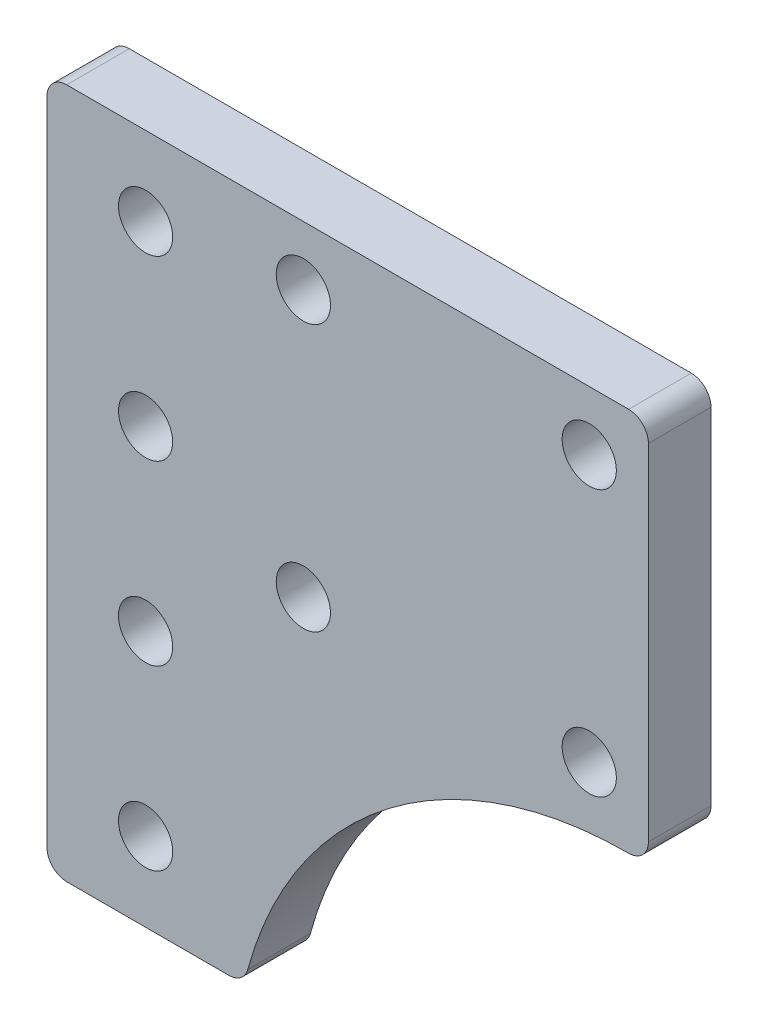
ISO-10303-21;
HEADER;
FILE_DESCRIPTION(('STEP AP214'),'2;1');
FILE_NAME('part.step','',(''),(''),'','','');
FILE_SCHEMA(('AUTOMOTIVE_DESIGN { 1 0 10303 214 1 1 1 1 }'));
ENDSEC;
DATA;
#1=APPLICATION_CONTEXT('core data for automotive mechanical design processes');
#2=APPLICATION_PROTOCOL_DEFINITION('international standard','automotive_design',2000,#1);
#3=PRODUCT_CONTEXT('',#1,'mechanical');
#4=PRODUCT('Part','Part','',(#3));
#5=PRODUCT_RELATED_PRODUCT_CATEGORY('part','',(#4));
#6=PRODUCT_DEFINITION_FORMATION('','',#4);
#7=PRODUCT_DEFINITION_CONTEXT('part definition',#1,'design');
#8=PRODUCT_DEFINITION('design','',#6,#7);
#9=PRODUCT_DEFINITION_SHAPE('','',#8);
#10=(LENGTH_UNIT() NAMED_UNIT(*) SI_UNIT(.MILLI.,.METRE.));
#11=(NAMED_UNIT(*) PLANE_ANGLE_UNIT() SI_UNIT($,.RADIAN.));
#12=(NAMED_UNIT(*) SI_UNIT($,.STERADIAN.) SOLID_ANGLE_UNIT());
#13=UNCERTAINTY_MEASURE_WITH_UNIT(LENGTH_MEASURE(1.E-05),#10,'distance_accuracy_value','');
#14=(GEOMETRIC_REPRESENTATION_CONTEXT(3) GLOBAL_UNCERTAINTY_ASSIGNED_CONTEXT((#13)) GLOBAL_UNIT_ASSIGNED_CONTEXT((#10,
#11,#12)) REPRESENTATION_CONTEXT('',''));
#15=CARTESIAN_POINT('',(0.,0.,0.));
#16=DIRECTION('',(0.,0.,1.));
#17=DIRECTION('',(1.,0.,0.));
#18=AXIS2_PLACEMENT_3D('',#15,#16,#17);
#19=CARTESIAN_POINT('',(0.,70.,6.35));
#20=DIRECTION('',(1.,0.,0.));
#21=DIRECTION('',(0.,0.,-1.));
#22=AXIS2_PLACEMENT_3D('',#19,#20,#21);
#23=PLANE('',#22);
#24=DIRECTION('',(0.,-1.,0.));
#25=VECTOR('',#24,1.);
#26=CARTESIAN_POINT('',(0.,70.,6.35));
#27=LINE('',#26,#25);
#28=CARTESIAN_POINT('',(0.,68.,6.35));
#29=VERTEX_POINT('',#28);
#30=CARTESIAN_POINT('',(0.,2.,6.35));
#31=VERTEX_POINT('',#30);
#32=EDGE_CURVE('E160',#29,#31,#27,.T.);
#33=ORIENTED_EDGE('',*,*,#32,.F.);
#34=DIRECTION('',(0.,0.,-1.));
#35=VECTOR('',#34,1.);
#36=CARTESIAN_POINT('',(0.,68.,6.35));
#37=LINE('',#36,#35);
#38=CARTESIAN_POINT('',(0.,68.,0.));
#39=VERTEX_POINT('',#38);
#40=EDGE_CURVE('E165',#29,#39,#37,.T.);
#41=ORIENTED_EDGE('',*,*,#40,.T.);
#42=DIRECTION('',(0.,-1.,0.));
#43=VECTOR('',#42,1.);
#44=CARTESIAN_POINT('',(0.,70.,0.));
#45=LINE('',#44,#43);
#46=CARTESIAN_POINT('',(0.,2.,0.));
#47=VERTEX_POINT('',#46);
#48=EDGE_CURVE('E155',#39,#47,#45,.T.);
#49=ORIENTED_EDGE('',*,*,#48,.T.);
#50=DIRECTION('',(0.,0.,-1.));
#51=VECTOR('',#50,1.);
#52=CARTESIAN_POINT('',(0.,2.,6.35));
#53=LINE('',#52,#51);
#54=EDGE_CURVE('E163',#47,#31,#53,.F.);
#55=ORIENTED_EDGE('',*,*,#54,.T.);
#56=EDGE_LOOP('',(#33,#41,#49,#55));
#57=FACE_BOUND('',#56,.T.);
#58=ADVANCED_FACE('F41',(#57),#23,.F.);
#59=CARTESIAN_POINT('',(0.,0.,6.35));
#60=DIRECTION('',(0.,1.,0.));
#61=DIRECTION('',(0.,0.,1.));
#62=AXIS2_PLACEMENT_3D('',#59,#60,#61);
#63=PLANE('',#62);
#64=DIRECTION('',(1.,0.,0.));
#65=VECTOR('',#64,1.);
#66=CARTESIAN_POINT('',(0.,0.,6.35));
#67=LINE('',#66,#65);
#68=CARTESIAN_POINT('',(2.,0.,6.35));
#69=VERTEX_POINT('',#68);
#70=CARTESIAN_POINT('',(18.4404141407877,0.,6.35));
#71=VERTEX_POINT('',#70);
#72=EDGE_CURVE('E206',#69,#71,#67,.T.);
#73=ORIENTED_EDGE('',*,*,#72,.F.);
#74=DIRECTION('',(0.,0.,-1.));
#75=VECTOR('',#74,1.);
#76=CARTESIAN_POINT('',(2.,0.,6.35));
#77=LINE('',#76,#75);
#78=CARTESIAN_POINT('',(2.,0.,0.));
#79=VERTEX_POINT('',#78);
#80=EDGE_CURVE('E49',#69,#79,#77,.T.);
#81=ORIENTED_EDGE('',*,*,#80,.T.);
#82=DIRECTION('',(1.,0.,0.));
#83=VECTOR('',#82,1.);
#84=CARTESIAN_POINT('',(0.,0.,0.));
#85=LINE('',#84,#83);
#86=CARTESIAN_POINT('',(18.4404141407877,0.,0.));
#87=VERTEX_POINT('',#86);
#88=EDGE_CURVE('E150',#79,#87,#85,.T.);
#89=ORIENTED_EDGE('',*,*,#88,.T.);
#90=DIRECTION('',(0.,0.,-1.));
#91=VECTOR('',#90,1.);
#92=CARTESIAN_POINT('',(18.4404141407877,0.,6.35));
#93=LINE('',#92,#91);
#94=EDGE_CURVE('E197',#87,#71,#93,.F.);
#95=ORIENTED_EDGE('',*,*,#94,.T.);
#96=EDGE_LOOP('',(#73,#81,#89,#95));
#97=FACE_BOUND('',#96,.T.);
#98=ADVANCED_FACE('F203',(#97),#63,.F.);
#99=CARTESIAN_POINT('',(20.,31.,6.35));
#100=DIRECTION('',(0.,1.,0.));
#101=DIRECTION('',(0.,0.,1.));
#102=AXIS2_PLACEMENT_3D('',#99,#100,#101);
#103=PLANE('',#102);
#104=DIRECTION('',(1.,0.,0.));
#105=VECTOR('',#104,1.);
#106=CARTESIAN_POINT('',(20.,31.,0.));
#107=LINE('',#106,#105);
#108=CARTESIAN_POINT('',(58.9743505398101,31.,0.));
#109=VERTEX_POINT('',#108);
#110=CARTESIAN_POINT('',(59.,31.,0.));
#111=VERTEX_POINT('',#110);
#112=EDGE_CURVE('E140',#109,#111,#107,.T.);
#113=ORIENTED_EDGE('',*,*,#112,.T.);
#114=DIRECTION('',(0.,0.,-1.));
#115=VECTOR('',#114,1.);
#116=CARTESIAN_POINT('',(59.,31.,6.35));
#117=LINE('',#116,#115);
#118=CARTESIAN_POINT('',(59.,31.,6.35));
#119=VERTEX_POINT('',#118);
#120=EDGE_CURVE('E195',#111,#119,#117,.F.);
#121=ORIENTED_EDGE('',*,*,#120,.T.);
#122=DIRECTION('',(1.,0.,0.));
#123=VECTOR('',#122,1.);
#124=CARTESIAN_POINT('',(20.,31.,6.35));
#125=LINE('',#124,#123);
#126=CARTESIAN_POINT('',(58.9743505398101,31.,6.35));
#127=VERTEX_POINT('',#126);
#128=EDGE_CURVE('E142',#127,#119,#125,.T.);
#129=ORIENTED_EDGE('',*,*,#128,.F.);
#130=DIRECTION('',(0.,0.,-1.));
#131=VECTOR('',#130,1.);
#132=CARTESIAN_POINT('',(58.9743505398101,31.,6.35));
#133=LINE('',#132,#131);
#134=EDGE_CURVE('E130',#127,#109,#133,.T.);
#135=ORIENTED_EDGE('',*,*,#134,.T.);
#136=EDGE_LOOP('',(#113,#121,#129,#135));
#137=FACE_BOUND('',#136,.T.);
#138=ADVANCED_FACE('F139',(#137),#103,.F.);
#139=CARTESIAN_POINT('',(61.,31.,6.35));
#140=DIRECTION('',(-1.,0.,0.));
#141=DIRECTION('',(0.,-1.,0.));
#142=AXIS2_PLACEMENT_3D('',#139,#140,#141);
#143=PLANE('',#142);
#144=DIRECTION('',(0.,1.,0.));
#145=VECTOR('',#144,1.);
#146=CARTESIAN_POINT('',(61.,31.,0.));
#147=LINE('',#146,#145);
#148=CARTESIAN_POINT('',(61.,33.,0.));
#149=VERTEX_POINT('',#148);
#150=CARTESIAN_POINT('',(61.,68.,0.));
#151=VERTEX_POINT('',#150);
#152=EDGE_CURVE('E149',#149,#151,#147,.T.);
#153=ORIENTED_EDGE('',*,*,#152,.T.);
#154=DIRECTION('',(0.,0.,-1.));
#155=VECTOR('',#154,1.);
#156=CARTESIAN_POINT('',(61.,68.,6.35));
#157=LINE('',#156,#155);
#158=CARTESIAN_POINT('',(61.,68.,6.35));
#159=VERTEX_POINT('',#158);
#160=EDGE_CURVE('E56',#151,#159,#157,.F.);
#161=ORIENTED_EDGE('',*,*,#160,.T.);
#162=DIRECTION('',(0.,1.,0.));
#163=VECTOR('',#162,1.);
#164=CARTESIAN_POINT('',(61.,31.,6.35));
#165=LINE('',#164,#163);
#166=CARTESIAN_POINT('',(61.,33.,6.35));
#167=VERTEX_POINT('',#166);
#168=EDGE_CURVE('E216',#167,#159,#165,.T.);
#169=ORIENTED_EDGE('',*,*,#168,.F.);
#170=DIRECTION('',(0.,0.,-1.));
#171=VECTOR('',#170,1.);
#172=CARTESIAN_POINT('',(61.,33.,6.35));
#173=LINE('',#172,#171);
#174=EDGE_CURVE('E191',#167,#149,#173,.T.);
#175=ORIENTED_EDGE('',*,*,#174,.T.);
#176=EDGE_LOOP('',(#153,#161,#169,#175));
#177=FACE_BOUND('',#176,.T.);
#178=ADVANCED_FACE('F348',(#177),#143,.F.);
#179=CARTESIAN_POINT('',(61.,70.,6.35));
#180=DIRECTION('',(0.,-1.,0.));
#181=DIRECTION('',(1.,0.,0.));
#182=AXIS2_PLACEMENT_3D('',#179,#180,#181);
#183=PLANE('',#182);
#184=DIRECTION('',(-1.,0.,0.));
#185=VECTOR('',#184,1.);
#186=CARTESIAN_POINT('',(61.,70.,0.));
#187=LINE('',#186,#185);
#188=CARTESIAN_POINT('',(59.,70.,0.));
#189=VERTEX_POINT('',#188);
#190=CARTESIAN_POINT('',(2.00000000000002,70.,0.));
#191=VERTEX_POINT('',#190);
#192=EDGE_CURVE('E152',#189,#191,#187,.T.);
#193=ORIENTED_EDGE('',*,*,#192,.T.);
#194=DIRECTION('',(0.,0.,-1.));
#195=VECTOR('',#194,1.);
#196=CARTESIAN_POINT('',(2.,70.,6.35));
#197=LINE('',#196,#195);
#198=CARTESIAN_POINT('',(2.00000000000002,70.,6.35));
#199=VERTEX_POINT('',#198);
#200=EDGE_CURVE('E180',#191,#199,#197,.F.);
#201=ORIENTED_EDGE('',*,*,#200,.T.);
#202=DIRECTION('',(-1.,0.,0.));
#203=VECTOR('',#202,1.);
#204=CARTESIAN_POINT('',(61.,70.,6.35));
#205=LINE('',#204,#203);
#206=CARTESIAN_POINT('',(59.,70.,6.35));
#207=VERTEX_POINT('',#206);
#208=EDGE_CURVE('E143',#207,#199,#205,.T.);
#209=ORIENTED_EDGE('',*,*,#208,.F.);
#210=DIRECTION('',(0.,0.,-1.));
#211=VECTOR('',#210,1.);
#212=CARTESIAN_POINT('',(59.,70.,6.35));
#213=LINE('',#212,#211);
#214=EDGE_CURVE('E177',#207,#189,#213,.T.);
#215=ORIENTED_EDGE('',*,*,#214,.T.);
#216=EDGE_LOOP('',(#193,#201,#209,#215));
#217=FACE_BOUND('',#216,.T.);
#218=ADVANCED_FACE('F286',(#217),#183,.F.);
#219=CARTESIAN_POINT('',(0.,0.,6.35));
#220=DIRECTION('',(0.,0.,1.));
#221=DIRECTION('',(1.,0.,0.));
#222=AXIS2_PLACEMENT_3D('',#219,#220,#221);
#223=PLANE('',#222);
#224=CARTESIAN_POINT('',(10.,8.00000000000001,6.35));
#225=DIRECTION('',(0.,0.,1.));
#226=DIRECTION('',(1.,0.,0.));
#227=AXIS2_PLACEMENT_3D('',#224,#225,#226);
#228=CIRCLE('',#227,2.75);
#229=CARTESIAN_POINT('',(12.75,8.00000000000001,6.35));
#230=VERTEX_POINT('',#229);
#231=EDGE_CURVE('E269',#230,#230,#228,.T.);
#232=ORIENTED_EDGE('',*,*,#231,.F.);
#233=EDGE_LOOP('',(#232));
#234=FACE_BOUND('',#233,.T.);
#235=CARTESIAN_POINT('',(10.,26.,6.35));
#236=DIRECTION('',(0.,0.,1.));
#237=DIRECTION('',(1.,0.,0.));
#238=AXIS2_PLACEMENT_3D('',#235,#236,#237);
#239=CIRCLE('',#238,2.75);
#240=CARTESIAN_POINT('',(12.75,26.,6.35));
#241=VERTEX_POINT('',#240);
#242=EDGE_CURVE('E266',#241,#241,#239,.T.);
#243=ORIENTED_EDGE('',*,*,#242,.F.);
#244=EDGE_LOOP('',(#243));
#245=FACE_BOUND('',#244,.T.);
#246=CARTESIAN_POINT('',(10.,44.,6.35));
#247=DIRECTION('',(0.,0.,1.));
#248=DIRECTION('',(1.,0.,0.));
#249=AXIS2_PLACEMENT_3D('',#246,#247,#248);
#250=CIRCLE('',#249,2.75);
#251=CARTESIAN_POINT('',(12.75,44.,6.35));
#252=VERTEX_POINT('',#251);
#253=EDGE_CURVE('E260',#252,#252,#250,.T.);
#254=ORIENTED_EDGE('',*,*,#253,.F.);
#255=EDGE_LOOP('',(#254));
#256=FACE_BOUND('',#255,.T.);
#257=CARTESIAN_POINT('',(10.,62.,6.35));
#258=DIRECTION('',(0.,0.,1.));
#259=DIRECTION('',(1.,0.,0.));
#260=AXIS2_PLACEMENT_3D('',#257,#258,#259);
#261=CIRCLE('',#260,2.75);
#262=CARTESIAN_POINT('',(12.75,62.,6.35));
#263=VERTEX_POINT('',#262);
#264=EDGE_CURVE('E254',#263,#263,#261,.T.);
#265=ORIENTED_EDGE('',*,*,#264,.F.);
#266=EDGE_LOOP('',(#265));
#267=FACE_BOUND('',#266,.T.);
#268=CARTESIAN_POINT('',(26.0000012986734,36.9999999999963,6.35));
#269=DIRECTION('',(0.,0.,1.));
#270=DIRECTION('',(1.,0.,0.));
#271=AXIS2_PLACEMENT_3D('',#268,#269,#270);
#272=CIRCLE('',#271,2.74999999999869);
#273=CARTESIAN_POINT('',(28.750001298672,36.9999999999963,6.35));
#274=VERTEX_POINT('',#273);
#275=EDGE_CURVE('E222',#274,#274,#272,.T.);
#276=ORIENTED_EDGE('',*,*,#275,.F.);
#277=EDGE_LOOP('',(#276));
#278=FACE_BOUND('',#277,.T.);
#279=CARTESIAN_POINT('',(54.9999999999982,36.9999999999964,6.35));
#280=DIRECTION('',(0.,0.,1.));
#281=DIRECTION('',(1.,0.,0.));
#282=AXIS2_PLACEMENT_3D('',#279,#280,#281);
#283=CIRCLE('',#282,2.7499999999987);
#284=CARTESIAN_POINT('',(57.7499999999969,36.9999999999964,6.35));
#285=VERTEX_POINT('',#284);
#286=EDGE_CURVE('E226',#285,#285,#283,.T.);
#287=ORIENTED_EDGE('',*,*,#286,.F.);
#288=EDGE_LOOP('',(#287));
#289=FACE_BOUND('',#288,.T.);
#290=CARTESIAN_POINT('',(54.999998701323,63.9999999999964,6.35));
#291=DIRECTION('',(0.,0.,1.));
#292=DIRECTION('',(1.,0.,0.));
#293=AXIS2_PLACEMENT_3D('',#290,#291,#292);
#294=CIRCLE('',#293,2.7499999999987);
#295=CARTESIAN_POINT('',(57.7499987013217,63.9999999999964,6.35));
#296=VERTEX_POINT('',#295);
#297=EDGE_CURVE('E230',#296,#296,#294,.T.);
#298=ORIENTED_EDGE('',*,*,#297,.F.);
#299=EDGE_LOOP('',(#298));
#300=FACE_BOUND('',#299,.T.);
#301=CARTESIAN_POINT('',(25.9999999999981,63.9999999999963,6.35));
#302=DIRECTION('',(0.,0.,1.));
#303=DIRECTION('',(1.,0.,0.));
#304=AXIS2_PLACEMENT_3D('',#301,#302,#303);
#305=CIRCLE('',#304,2.74999999999869);
#306=CARTESIAN_POINT('',(28.7499999999968,63.9999999999963,6.35));
#307=VERTEX_POINT('',#306);
#308=EDGE_CURVE('E235',#307,#307,#305,.T.);
#309=ORIENTED_EDGE('',*,*,#308,.F.);
#310=EDGE_LOOP('',(#309));
#311=FACE_BOUND('',#310,.T.);
#312=ORIENTED_EDGE('',*,*,#208,.T.);
#313=CARTESIAN_POINT('',(2.,68.,6.35));
#314=DIRECTION('',(0.,0.,1.));
#315=DIRECTION('',(1.,0.,0.));
#316=AXIS2_PLACEMENT_3D('',#313,#314,#315);
#317=CIRCLE('',#316,2.);
#318=EDGE_CURVE('E189',#199,#29,#317,.T.);
#319=ORIENTED_EDGE('',*,*,#318,.T.);
#320=ORIENTED_EDGE('',*,*,#32,.T.);
#321=CARTESIAN_POINT('',(2.,2.,6.35));
#322=DIRECTION('',(0.,0.,1.));
#323=DIRECTION('',(1.,0.,0.));
#324=AXIS2_PLACEMENT_3D('',#321,#322,#323);
#325=CIRCLE('',#324,2.);
#326=EDGE_CURVE('E184',#31,#69,#325,.T.);
#327=ORIENTED_EDGE('',*,*,#326,.T.);
#328=ORIENTED_EDGE('',*,*,#72,.T.);
#329=CARTESIAN_POINT('',(18.4404141407877,2.,6.35));
#330=DIRECTION('',(0.,0.,1.));
#331=DIRECTION('',(1.,0.,0.));
#332=AXIS2_PLACEMENT_3D('',#329,#330,#331);
#333=CIRCLE('',#332,2.);
#334=CARTESIAN_POINT('',(20.3706015883602,1.47619047619048,6.35));
#335=VERTEX_POINT('',#334);
#336=EDGE_CURVE('E182',#71,#335,#333,.T.);
#337=ORIENTED_EDGE('',*,*,#336,.T.);
#338=CARTESIAN_POINT('',(58.9743505398101,-9.,6.35));
#339=DIRECTION('',(0.,0.,1.));
#340=DIRECTION('',(1.,0.,0.));
#341=AXIS2_PLACEMENT_3D('',#338,#339,#340);
#342=CIRCLE('',#341,40.);
#343=EDGE_CURVE('E134',#335,#127,#342,.F.);
#344=ORIENTED_EDGE('',*,*,#343,.T.);
#345=ORIENTED_EDGE('',*,*,#128,.T.);
#346=CARTESIAN_POINT('',(59.,33.,6.35));
#347=DIRECTION('',(0.,0.,1.));
#348=DIRECTION('',(1.,0.,0.));
#349=AXIS2_PLACEMENT_3D('',#346,#347,#348);
#350=CIRCLE('',#349,2.);
#351=EDGE_CURVE('E63',#119,#167,#350,.T.);
#352=ORIENTED_EDGE('',*,*,#351,.T.);
#353=ORIENTED_EDGE('',*,*,#168,.T.);
#354=CARTESIAN_POINT('',(59.,68.,6.35));
#355=DIRECTION('',(0.,0.,1.));
#356=DIRECTION('',(1.,0.,0.));
#357=AXIS2_PLACEMENT_3D('',#354,#355,#356);
#358=CIRCLE('',#357,2.);
#359=EDGE_CURVE('E187',#159,#207,#358,.T.);
#360=ORIENTED_EDGE('',*,*,#359,.T.);
#361=EDGE_LOOP('',(#312,#319,#320,#327,#328,#337,#344,#345,#352,#353,#360));
#362=FACE_BOUND('',#361,.T.);
#363=ADVANCED_FACE('F213',(#234,#245,#256,#267,#278,#289,#300,#311,#362),#223,.T.);
#364=CARTESIAN_POINT('',(0.,0.,0.));
#365=DIRECTION('',(0.,0.,1.));
#366=DIRECTION('',(1.,0.,0.));
#367=AXIS2_PLACEMENT_3D('',#364,#365,#366);
#368=PLANE('',#367);
#369=CARTESIAN_POINT('',(10.,8.00000000000001,0.));
#370=DIRECTION('',(0.,0.,1.));
#371=DIRECTION('',(1.,0.,0.));
#372=AXIS2_PLACEMENT_3D('',#369,#370,#371);
#373=CIRCLE('',#372,2.75);
#374=CARTESIAN_POINT('',(12.75,8.00000000000001,0.));
#375=VERTEX_POINT('',#374);
#376=EDGE_CURVE('E246',#375,#375,#373,.T.);
#377=ORIENTED_EDGE('',*,*,#376,.T.);
#378=EDGE_LOOP('',(#377));
#379=FACE_BOUND('',#378,.T.);
#380=CARTESIAN_POINT('',(10.,26.,0.));
#381=DIRECTION('',(0.,0.,1.));
#382=DIRECTION('',(1.,0.,0.));
#383=AXIS2_PLACEMENT_3D('',#380,#381,#382);
#384=CIRCLE('',#383,2.75);
#385=CARTESIAN_POINT('',(12.75,26.,0.));
#386=VERTEX_POINT('',#385);
#387=EDGE_CURVE('E263',#386,#386,#384,.T.);
#388=ORIENTED_EDGE('',*,*,#387,.T.);
#389=EDGE_LOOP('',(#388));
#390=FACE_BOUND('',#389,.T.);
#391=CARTESIAN_POINT('',(10.,44.,0.));
#392=DIRECTION('',(0.,0.,1.));
#393=DIRECTION('',(1.,0.,0.));
#394=AXIS2_PLACEMENT_3D('',#391,#392,#393);
#395=CIRCLE('',#394,2.75);
#396=CARTESIAN_POINT('',(12.75,44.,0.));
#397=VERTEX_POINT('',#396);
#398=EDGE_CURVE('E257',#397,#397,#395,.T.);
#399=ORIENTED_EDGE('',*,*,#398,.T.);
#400=EDGE_LOOP('',(#399));
#401=FACE_BOUND('',#400,.T.);
#402=CARTESIAN_POINT('',(10.,62.,0.));
#403=DIRECTION('',(0.,0.,1.));
#404=DIRECTION('',(1.,0.,0.));
#405=AXIS2_PLACEMENT_3D('',#402,#403,#404);
#406=CIRCLE('',#405,2.75);
#407=CARTESIAN_POINT('',(12.75,62.,0.));
#408=VERTEX_POINT('',#407);
#409=EDGE_CURVE('E251',#408,#408,#406,.T.);
#410=ORIENTED_EDGE('',*,*,#409,.T.);
#411=EDGE_LOOP('',(#410));
#412=FACE_BOUND('',#411,.T.);
#413=CARTESIAN_POINT('',(26.0000012986734,36.9999999999963,0.));
#414=DIRECTION('',(0.,0.,-1.));
#415=DIRECTION('',(-1.,0.,0.));
#416=AXIS2_PLACEMENT_3D('',#413,#414,#415);
#417=CIRCLE('',#416,2.74999999999869);
#418=CARTESIAN_POINT('',(23.2500012986747,36.9999999999963,0.));
#419=VERTEX_POINT('',#418);
#420=EDGE_CURVE('E242',#419,#419,#417,.T.);
#421=ORIENTED_EDGE('',*,*,#420,.F.);
#422=EDGE_LOOP('',(#421));
#423=FACE_BOUND('',#422,.T.);
#424=CARTESIAN_POINT('',(54.9999999999982,36.9999999999964,0.));
#425=DIRECTION('',(0.,0.,-1.));
#426=DIRECTION('',(-1.,0.,0.));
#427=AXIS2_PLACEMENT_3D('',#424,#425,#426);
#428=CIRCLE('',#427,2.7499999999987);
#429=CARTESIAN_POINT('',(52.2499999999995,36.9999999999964,0.));
#430=VERTEX_POINT('',#429);
#431=EDGE_CURVE('E245',#430,#430,#428,.T.);
#432=ORIENTED_EDGE('',*,*,#431,.F.);
#433=EDGE_LOOP('',(#432));
#434=FACE_BOUND('',#433,.T.);
#435=CARTESIAN_POINT('',(54.999998701323,63.9999999999964,0.));
#436=DIRECTION('',(0.,0.,-1.));
#437=DIRECTION('',(-1.,0.,0.));
#438=AXIS2_PLACEMENT_3D('',#435,#436,#437);
#439=CIRCLE('',#438,2.7499999999987);
#440=CARTESIAN_POINT('',(52.2499987013243,63.9999999999964,0.));
#441=VERTEX_POINT('',#440);
#442=EDGE_CURVE('E241',#441,#441,#439,.T.);
#443=ORIENTED_EDGE('',*,*,#442,.F.);
#444=EDGE_LOOP('',(#443));
#445=FACE_BOUND('',#444,.T.);
#446=CARTESIAN_POINT('',(25.9999999999981,63.9999999999963,0.));
#447=DIRECTION('',(0.,0.,-1.));
#448=DIRECTION('',(-1.,0.,0.));
#449=AXIS2_PLACEMENT_3D('',#446,#447,#448);
#450=CIRCLE('',#449,2.74999999999869);
#451=CARTESIAN_POINT('',(23.2499999999994,63.9999999999963,0.));
#452=VERTEX_POINT('',#451);
#453=EDGE_CURVE('E238',#452,#452,#450,.T.);
#454=ORIENTED_EDGE('',*,*,#453,.F.);
#455=EDGE_LOOP('',(#454));
#456=FACE_BOUND('',#455,.T.);
#457=ORIENTED_EDGE('',*,*,#48,.F.);
#458=CARTESIAN_POINT('',(2.,68.,0.));
#459=DIRECTION('',(0.,0.,1.));
#460=DIRECTION('',(1.,0.,0.));
#461=AXIS2_PLACEMENT_3D('',#458,#459,#460);
#462=CIRCLE('',#461,2.);
#463=EDGE_CURVE('E175',#39,#191,#462,.F.);
#464=ORIENTED_EDGE('',*,*,#463,.T.);
#465=ORIENTED_EDGE('',*,*,#192,.F.);
#466=CARTESIAN_POINT('',(59.,68.,0.));
#467=DIRECTION('',(0.,0.,1.));
#468=DIRECTION('',(1.,0.,0.));
#469=AXIS2_PLACEMENT_3D('',#466,#467,#468);
#470=CIRCLE('',#469,2.);
#471=EDGE_CURVE('E173',#189,#151,#470,.F.);
#472=ORIENTED_EDGE('',*,*,#471,.T.);
#473=ORIENTED_EDGE('',*,*,#152,.F.);
#474=CARTESIAN_POINT('',(59.,33.,0.));
#475=DIRECTION('',(0.,0.,1.));
#476=DIRECTION('',(1.,0.,0.));
#477=AXIS2_PLACEMENT_3D('',#474,#475,#476);
#478=CIRCLE('',#477,2.);
#479=EDGE_CURVE('E148',#149,#111,#478,.F.);
#480=ORIENTED_EDGE('',*,*,#479,.T.);
#481=ORIENTED_EDGE('',*,*,#112,.F.);
#482=CARTESIAN_POINT('',(58.9743505398101,-9.,0.));
#483=DIRECTION('',(0.,0.,1.));
#484=DIRECTION('',(1.,0.,0.));
#485=AXIS2_PLACEMENT_3D('',#482,#483,#484);
#486=CIRCLE('',#485,40.);
#487=CARTESIAN_POINT('',(20.3706015883602,1.47619047619048,0.));
#488=VERTEX_POINT('',#487);
#489=EDGE_CURVE('E126',#109,#488,#486,.T.);
#490=ORIENTED_EDGE('',*,*,#489,.T.);
#491=CARTESIAN_POINT('',(18.4404141407877,2.,0.));
#492=DIRECTION('',(0.,0.,1.));
#493=DIRECTION('',(1.,0.,0.));
#494=AXIS2_PLACEMENT_3D('',#491,#492,#493);
#495=CIRCLE('',#494,2.);
#496=EDGE_CURVE('E168',#488,#87,#495,.F.);
#497=ORIENTED_EDGE('',*,*,#496,.T.);
#498=ORIENTED_EDGE('',*,*,#88,.F.);
#499=CARTESIAN_POINT('',(2.,2.,0.));
#500=DIRECTION('',(0.,0.,1.));
#501=DIRECTION('',(1.,0.,0.));
#502=AXIS2_PLACEMENT_3D('',#499,#500,#501);
#503=CIRCLE('',#502,2.);
#504=EDGE_CURVE('E170',#79,#47,#503,.F.);
#505=ORIENTED_EDGE('',*,*,#504,.T.);
#506=EDGE_LOOP('',(#457,#464,#465,#472,#473,#480,#481,#490,#497,#498,#505));
#507=FACE_BOUND('',#506,.T.);
#508=ADVANCED_FACE('F146',(#379,#390,#401,#412,#423,#434,#445,#456,#507),#368,.F.);
#509=CARTESIAN_POINT('',(25.9999999999981,63.9999999999963,10.));
#510=DIRECTION('',(0.,0.,-1.));
#511=DIRECTION('',(-1.,0.,0.));
#512=AXIS2_PLACEMENT_3D('',#509,#510,#511);
#513=CYLINDRICAL_SURFACE('',#512,2.74999999999869);
#514=ORIENTED_EDGE('',*,*,#308,.T.);
#515=EDGE_LOOP('',(#514));
#516=FACE_BOUND('',#515,.T.);
#517=ORIENTED_EDGE('',*,*,#453,.T.);
#518=EDGE_LOOP('',(#517));
#519=FACE_BOUND('',#518,.T.);
#520=ADVANCED_FACE('F301',(#516,#519),#513,.F.);
#521=CARTESIAN_POINT('',(54.999998701323,63.9999999999964,10.));
#522=DIRECTION('',(0.,0.,-1.));
#523=DIRECTION('',(-1.,0.,0.));
#524=AXIS2_PLACEMENT_3D('',#521,#522,#523);
#525=CYLINDRICAL_SURFACE('',#524,2.7499999999987);
#526=ORIENTED_EDGE('',*,*,#297,.T.);
#527=EDGE_LOOP('',(#526));
#528=FACE_BOUND('',#527,.T.);
#529=ORIENTED_EDGE('',*,*,#442,.T.);
#530=EDGE_LOOP('',(#529));
#531=FACE_BOUND('',#530,.T.);
#532=ADVANCED_FACE('F304',(#528,#531),#525,.F.);
#533=CARTESIAN_POINT('',(54.9999999999982,36.9999999999964,10.));
#534=DIRECTION('',(0.,0.,-1.));
#535=DIRECTION('',(-1.,0.,0.));
#536=AXIS2_PLACEMENT_3D('',#533,#534,#535);
#537=CYLINDRICAL_SURFACE('',#536,2.7499999999987);
#538=ORIENTED_EDGE('',*,*,#286,.T.);
#539=EDGE_LOOP('',(#538));
#540=FACE_BOUND('',#539,.T.);
#541=ORIENTED_EDGE('',*,*,#431,.T.);
#542=EDGE_LOOP('',(#541));
#543=FACE_BOUND('',#542,.T.);
#544=ADVANCED_FACE('F400',(#540,#543),#537,.F.);
#545=CARTESIAN_POINT('',(26.0000012986734,36.9999999999963,10.));
#546=DIRECTION('',(0.,0.,-1.));
#547=DIRECTION('',(-1.,0.,0.));
#548=AXIS2_PLACEMENT_3D('',#545,#546,#547);
#549=CYLINDRICAL_SURFACE('',#548,2.74999999999869);
#550=ORIENTED_EDGE('',*,*,#275,.T.);
#551=EDGE_LOOP('',(#550));
#552=FACE_BOUND('',#551,.T.);
#553=ORIENTED_EDGE('',*,*,#420,.T.);
#554=EDGE_LOOP('',(#553));
#555=FACE_BOUND('',#554,.T.);
#556=ADVANCED_FACE('F409',(#552,#555),#549,.F.);
#557=CARTESIAN_POINT('',(10.,62.,0.));
#558=DIRECTION('',(0.,0.,1.));
#559=DIRECTION('',(1.,0.,0.));
#560=AXIS2_PLACEMENT_3D('',#557,#558,#559);
#561=CYLINDRICAL_SURFACE('',#560,2.75);
#562=ORIENTED_EDGE('',*,*,#409,.F.);
#563=EDGE_LOOP('',(#562));
#564=FACE_BOUND('',#563,.T.);
#565=ORIENTED_EDGE('',*,*,#264,.T.);
#566=EDGE_LOOP('',(#565));
#567=FACE_BOUND('',#566,.T.);
#568=ADVANCED_FACE('F418',(#564,#567),#561,.F.);
#569=CARTESIAN_POINT('',(10.,44.,0.));
#570=DIRECTION('',(0.,0.,1.));
#571=DIRECTION('',(1.,0.,0.));
#572=AXIS2_PLACEMENT_3D('',#569,#570,#571);
#573=CYLINDRICAL_SURFACE('',#572,2.75);
#574=ORIENTED_EDGE('',*,*,#398,.F.);
#575=EDGE_LOOP('',(#574));
#576=FACE_BOUND('',#575,.T.);
#577=ORIENTED_EDGE('',*,*,#253,.T.);
#578=EDGE_LOOP('',(#577));
#579=FACE_BOUND('',#578,.T.);
#580=ADVANCED_FACE('F426',(#576,#579),#573,.F.);
#581=CARTESIAN_POINT('',(10.,26.,0.));
#582=DIRECTION('',(0.,0.,1.));
#583=DIRECTION('',(1.,0.,0.));
#584=AXIS2_PLACEMENT_3D('',#581,#582,#583);
#585=CYLINDRICAL_SURFACE('',#584,2.75);
#586=ORIENTED_EDGE('',*,*,#387,.F.);
#587=EDGE_LOOP('',(#586));
#588=FACE_BOUND('',#587,.T.);
#589=ORIENTED_EDGE('',*,*,#242,.T.);
#590=EDGE_LOOP('',(#589));
#591=FACE_BOUND('',#590,.T.);
#592=ADVANCED_FACE('F280',(#588,#591),#585,.F.);
#593=CARTESIAN_POINT('',(10.,8.00000000000001,0.));
#594=DIRECTION('',(0.,0.,1.));
#595=DIRECTION('',(1.,0.,0.));
#596=AXIS2_PLACEMENT_3D('',#593,#594,#595);
#597=CYLINDRICAL_SURFACE('',#596,2.75);
#598=ORIENTED_EDGE('',*,*,#376,.F.);
#599=EDGE_LOOP('',(#598));
#600=FACE_BOUND('',#599,.T.);
#601=ORIENTED_EDGE('',*,*,#231,.T.);
#602=EDGE_LOOP('',(#601));
#603=FACE_BOUND('',#602,.T.);
#604=ADVANCED_FACE('F277',(#600,#603),#597,.F.);
#605=CARTESIAN_POINT('',(58.9743505398101,-9.,6.35));
#606=DIRECTION('',(0.,0.,-1.));
#607=DIRECTION('',(-1.,0.,0.));
#608=AXIS2_PLACEMENT_3D('',#605,#606,#607);
#609=CYLINDRICAL_SURFACE('',#608,40.);
#610=ORIENTED_EDGE('',*,*,#343,.F.);
#611=DIRECTION('',(0.,0.,-1.));
#612=VECTOR('',#611,1.);
#613=CARTESIAN_POINT('',(20.3706015883602,1.47619047619048,6.35));
#614=LINE('',#613,#612);
#615=EDGE_CURVE('E11',#335,#488,#614,.T.);
#616=ORIENTED_EDGE('',*,*,#615,.T.);
#617=ORIENTED_EDGE('',*,*,#489,.F.);
#618=ORIENTED_EDGE('',*,*,#134,.F.);
#619=EDGE_LOOP('',(#610,#616,#617,#618));
#620=FACE_BOUND('',#619,.T.);
#621=ADVANCED_FACE('F129',(#620),#609,.F.);
#622=CARTESIAN_POINT('',(2.,68.,6.35));
#623=DIRECTION('',(0.,0.,-1.));
#624=DIRECTION('',(-1.,0.,0.));
#625=AXIS2_PLACEMENT_3D('',#622,#623,#624);
#626=CYLINDRICAL_SURFACE('',#625,2.);
#627=ORIENTED_EDGE('',*,*,#318,.F.);
#628=ORIENTED_EDGE('',*,*,#200,.F.);
#629=ORIENTED_EDGE('',*,*,#463,.F.);
#630=ORIENTED_EDGE('',*,*,#40,.F.);
#631=EDGE_LOOP('',(#627,#628,#629,#630));
#632=FACE_BOUND('',#631,.T.);
#633=ADVANCED_FACE('F324',(#632),#626,.T.);
#634=CARTESIAN_POINT('',(59.,68.,6.35));
#635=DIRECTION('',(0.,0.,-1.));
#636=DIRECTION('',(-1.,0.,0.));
#637=AXIS2_PLACEMENT_3D('',#634,#635,#636);
#638=CYLINDRICAL_SURFACE('',#637,2.);
#639=ORIENTED_EDGE('',*,*,#359,.F.);
#640=ORIENTED_EDGE('',*,*,#160,.F.);
#641=ORIENTED_EDGE('',*,*,#471,.F.);
#642=ORIENTED_EDGE('',*,*,#214,.F.);
#643=EDGE_LOOP('',(#639,#640,#641,#642));
#644=FACE_BOUND('',#643,.T.);
#645=ADVANCED_FACE('F327',(#644),#638,.T.);
#646=CARTESIAN_POINT('',(59.,33.,6.35));
#647=DIRECTION('',(0.,0.,-1.));
#648=DIRECTION('',(-1.,0.,0.));
#649=AXIS2_PLACEMENT_3D('',#646,#647,#648);
#650=CYLINDRICAL_SURFACE('',#649,2.);
#651=ORIENTED_EDGE('',*,*,#351,.F.);
#652=ORIENTED_EDGE('',*,*,#120,.F.);
#653=ORIENTED_EDGE('',*,*,#479,.F.);
#654=ORIENTED_EDGE('',*,*,#174,.F.);
#655=EDGE_LOOP('',(#651,#652,#653,#654));
#656=FACE_BOUND('',#655,.T.);
#657=ADVANCED_FACE('F331',(#656),#650,.T.);
#658=CARTESIAN_POINT('',(2.,2.,6.35));
#659=DIRECTION('',(0.,0.,-1.));
#660=DIRECTION('',(-1.,0.,0.));
#661=AXIS2_PLACEMENT_3D('',#658,#659,#660);
#662=CYLINDRICAL_SURFACE('',#661,2.);
#663=ORIENTED_EDGE('',*,*,#326,.F.);
#664=ORIENTED_EDGE('',*,*,#54,.F.);
#665=ORIENTED_EDGE('',*,*,#504,.F.);
#666=ORIENTED_EDGE('',*,*,#80,.F.);
#667=EDGE_LOOP('',(#663,#664,#665,#666));
#668=FACE_BOUND('',#667,.T.);
#669=ADVANCED_FACE('F334',(#668),#662,.T.);
#670=CARTESIAN_POINT('',(18.4404141407877,2.,6.35));
#671=DIRECTION('',(0.,0.,-1.));
#672=DIRECTION('',(-1.,0.,0.));
#673=AXIS2_PLACEMENT_3D('',#670,#671,#672);
#674=CYLINDRICAL_SURFACE('',#673,2.);
#675=ORIENTED_EDGE('',*,*,#336,.F.);
#676=ORIENTED_EDGE('',*,*,#94,.F.);
#677=ORIENTED_EDGE('',*,*,#496,.F.);
#678=ORIENTED_EDGE('',*,*,#615,.F.);
#679=EDGE_LOOP('',(#675,#676,#677,#678));
#680=FACE_BOUND('',#679,.T.);
#681=ADVANCED_FACE('F43',(#680),#674,.T.);
#682=CLOSED_SHELL('',(#58,#98,#138,#178,#218,#363,#508,#520,#532,#544,#556,#568,#580,#592,#604,
#621,#633,#645,#657,#669,#681));
#683=MANIFOLD_SOLID_BREP('B2',#682);
#684=ADVANCED_BREP_SHAPE_REPRESENTATION('',(#18,#683),#14);
#685=SHAPE_DEFINITION_REPRESENTATION(#9,#684);
ENDSEC;
END-ISO-10303-21;
